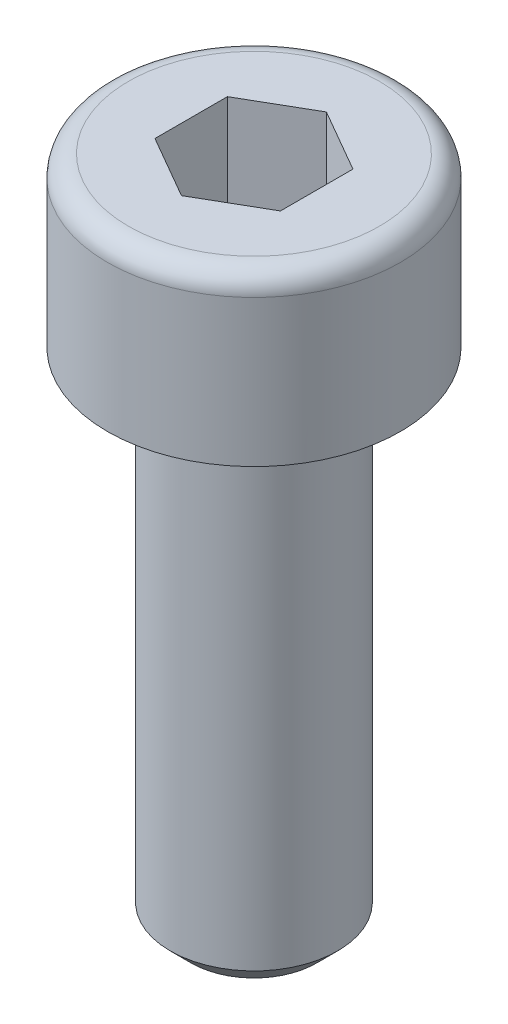
ISO-10303-21;
HEADER;
FILE_DESCRIPTION(('STEP AP214'),'2;1');
FILE_NAME('part.step','',(''),(''),'','','');
FILE_SCHEMA(('AUTOMOTIVE_DESIGN { 1 0 10303 214 1 1 1 1 }'));
ENDSEC;
DATA;
#1=APPLICATION_CONTEXT('core data for automotive mechanical design processes');
#2=APPLICATION_PROTOCOL_DEFINITION('international standard','automotive_design',2000,#1);
#3=PRODUCT_CONTEXT('',#1,'mechanical');
#4=PRODUCT('Part','Part','',(#3));
#5=PRODUCT_RELATED_PRODUCT_CATEGORY('part','',(#4));
#6=PRODUCT_DEFINITION_FORMATION('','',#4);
#7=PRODUCT_DEFINITION_CONTEXT('part definition',#1,'design');
#8=PRODUCT_DEFINITION('design','',#6,#7);
#9=PRODUCT_DEFINITION_SHAPE('','',#8);
#10=(LENGTH_UNIT() NAMED_UNIT(*) SI_UNIT(.MILLI.,.METRE.));
#11=(NAMED_UNIT(*) PLANE_ANGLE_UNIT() SI_UNIT($,.RADIAN.));
#12=(NAMED_UNIT(*) SI_UNIT($,.STERADIAN.) SOLID_ANGLE_UNIT());
#13=UNCERTAINTY_MEASURE_WITH_UNIT(LENGTH_MEASURE(1.E-05),#10,'distance_accuracy_value','');
#14=(GEOMETRIC_REPRESENTATION_CONTEXT(3) GLOBAL_UNCERTAINTY_ASSIGNED_CONTEXT((#13)) GLOBAL_UNIT_ASSIGNED_CONTEXT((#10,
#11,#12)) REPRESENTATION_CONTEXT('',''));
#15=CARTESIAN_POINT('',(0.,0.,0.));
#16=DIRECTION('',(0.,0.,1.));
#17=DIRECTION('',(1.,0.,0.));
#18=AXIS2_PLACEMENT_3D('',#15,#16,#17);
#19=CARTESIAN_POINT('',(0.,0.,0.));
#20=DIRECTION('',(0.,-1.,0.));
#21=DIRECTION('',(0.,0.,-1.));
#22=AXIS2_PLACEMENT_3D('',#19,#20,#21);
#23=PLANE('',#22);
#24=CARTESIAN_POINT('',(0.,0.,0.));
#25=DIRECTION('',(0.,-1.,0.));
#26=DIRECTION('',(0.,0.,-1.));
#27=AXIS2_PLACEMENT_3D('',#24,#25,#26);
#28=CIRCLE('',#27,3.);
#29=CARTESIAN_POINT('',(0.,0.,-3.));
#30=VERTEX_POINT('',#29);
#31=EDGE_CURVE('E42',#30,#30,#28,.F.);
#32=ORIENTED_EDGE('',*,*,#31,.T.);
#33=EDGE_LOOP('',(#32));
#34=FACE_BOUND('',#33,.T.);
#35=DIRECTION('',(-0.866025403784439,0.,-0.5));
#36=VECTOR('',#35,1.);
#37=CARTESIAN_POINT('',(1.5,0.,-0.866025403784438));
#38=LINE('',#37,#36);
#39=CARTESIAN_POINT('',(1.5,0.,-0.866025403784438));
#40=VERTEX_POINT('',#39);
#41=CARTESIAN_POINT('',(0.,0.,-1.73205080756888));
#42=VERTEX_POINT('',#41);
#43=EDGE_CURVE('E123',#40,#42,#38,.T.);
#44=ORIENTED_EDGE('',*,*,#43,.F.);
#45=DIRECTION('',(0.,0.,-1.));
#46=VECTOR('',#45,1.);
#47=CARTESIAN_POINT('',(1.5,0.,0.866025403784439));
#48=LINE('',#47,#46);
#49=CARTESIAN_POINT('',(1.5,0.,0.866025403784439));
#50=VERTEX_POINT('',#49);
#51=EDGE_CURVE('E49',#50,#40,#48,.T.);
#52=ORIENTED_EDGE('',*,*,#51,.F.);
#53=DIRECTION('',(0.866025403784439,0.,-0.5));
#54=VECTOR('',#53,1.);
#55=CARTESIAN_POINT('',(0.,0.,1.73205080756888));
#56=LINE('',#55,#54);
#57=CARTESIAN_POINT('',(0.,0.,1.73205080756888));
#58=VERTEX_POINT('',#57);
#59=EDGE_CURVE('E132',#58,#50,#56,.T.);
#60=ORIENTED_EDGE('',*,*,#59,.F.);
#61=DIRECTION('',(0.866025403784439,0.,0.5));
#62=VECTOR('',#61,1.);
#63=CARTESIAN_POINT('',(-1.5,0.,0.866025403784438));
#64=LINE('',#63,#62);
#65=CARTESIAN_POINT('',(-1.5,0.,0.866025403784438));
#66=VERTEX_POINT('',#65);
#67=EDGE_CURVE('E130',#66,#58,#64,.T.);
#68=ORIENTED_EDGE('',*,*,#67,.F.);
#69=DIRECTION('',(0.,0.,1.));
#70=VECTOR('',#69,1.);
#71=CARTESIAN_POINT('',(-1.5,0.,-0.866025403784439));
#72=LINE('',#71,#70);
#73=CARTESIAN_POINT('',(-1.5,0.,-0.866025403784439));
#74=VERTEX_POINT('',#73);
#75=EDGE_CURVE('E97',#74,#66,#72,.T.);
#76=ORIENTED_EDGE('',*,*,#75,.F.);
#77=DIRECTION('',(-0.866025403784439,0.,0.5));
#78=VECTOR('',#77,1.);
#79=CARTESIAN_POINT('',(0.,0.,-1.73205080756888));
#80=LINE('',#79,#78);
#81=EDGE_CURVE('E126',#42,#74,#80,.T.);
#82=ORIENTED_EDGE('',*,*,#81,.F.);
#83=EDGE_LOOP('',(#44,#52,#60,#68,#76,#82));
#84=FACE_BOUND('',#83,.T.);
#85=ADVANCED_FACE('F34',(#34,#84),#23,.F.);
#86=CARTESIAN_POINT('',(0.,0.,0.));
#87=DIRECTION('',(0.,1.,0.));
#88=DIRECTION('',(0.,0.,1.));
#89=AXIS2_PLACEMENT_3D('',#86,#87,#88);
#90=CYLINDRICAL_SURFACE('',#89,3.5);
#91=CARTESIAN_POINT('',(0.,-0.5,0.));
#92=DIRECTION('',(0.,-1.,0.));
#93=DIRECTION('',(0.,0.,-1.));
#94=AXIS2_PLACEMENT_3D('',#91,#92,#93);
#95=CIRCLE('',#94,3.5);
#96=CARTESIAN_POINT('',(0.,-0.5,-3.5));
#97=VERTEX_POINT('',#96);
#98=EDGE_CURVE('E11',#97,#97,#95,.T.);
#99=ORIENTED_EDGE('',*,*,#98,.T.);
#100=EDGE_LOOP('',(#99));
#101=FACE_BOUND('',#100,.T.);
#102=CARTESIAN_POINT('',(0.,-4.,0.));
#103=DIRECTION('',(0.,1.,0.));
#104=DIRECTION('',(0.,0.,1.));
#105=AXIS2_PLACEMENT_3D('',#102,#103,#104);
#106=CIRCLE('',#105,3.5);
#107=CARTESIAN_POINT('',(0.,-4.,3.5));
#108=VERTEX_POINT('',#107);
#109=EDGE_CURVE('E144',#108,#108,#106,.T.);
#110=ORIENTED_EDGE('',*,*,#109,.T.);
#111=EDGE_LOOP('',(#110));
#112=FACE_BOUND('',#111,.T.);
#113=ADVANCED_FACE('F166',(#101,#112),#90,.T.);
#114=CARTESIAN_POINT('',(3.5,-4.,0.));
#115=DIRECTION('',(0.,1.,0.));
#116=DIRECTION('',(0.,0.,1.));
#117=AXIS2_PLACEMENT_3D('',#114,#115,#116);
#118=PLANE('',#117);
#119=ORIENTED_EDGE('',*,*,#109,.F.);
#120=EDGE_LOOP('',(#119));
#121=FACE_BOUND('',#120,.T.);
#122=CARTESIAN_POINT('',(0.,-4.,0.));
#123=DIRECTION('',(0.,1.,0.));
#124=DIRECTION('',(0.,0.,1.));
#125=AXIS2_PLACEMENT_3D('',#122,#123,#124);
#126=CIRCLE('',#125,2.);
#127=CARTESIAN_POINT('',(0.,-4.,2.));
#128=VERTEX_POINT('',#127);
#129=EDGE_CURVE('E136',#128,#128,#126,.T.);
#130=ORIENTED_EDGE('',*,*,#129,.T.);
#131=EDGE_LOOP('',(#130));
#132=FACE_BOUND('',#131,.T.);
#133=ADVANCED_FACE('F171',(#121,#132),#118,.F.);
#134=CARTESIAN_POINT('',(0.,0.,0.));
#135=DIRECTION('',(0.,1.,0.));
#136=DIRECTION('',(0.,0.,1.));
#137=AXIS2_PLACEMENT_3D('',#134,#135,#136);
#138=CYLINDRICAL_SURFACE('',#137,2.);
#139=CARTESIAN_POINT('',(0.,-15.5,0.));
#140=DIRECTION('',(0.,1.,0.));
#141=DIRECTION('',(0.,0.,1.));
#142=AXIS2_PLACEMENT_3D('',#139,#140,#141);
#143=CIRCLE('',#142,2.);
#144=CARTESIAN_POINT('',(0.,-15.5,2.));
#145=VERTEX_POINT('',#144);
#146=EDGE_CURVE('E147',#145,#145,#143,.T.);
#147=ORIENTED_EDGE('',*,*,#146,.T.);
#148=EDGE_LOOP('',(#147));
#149=FACE_BOUND('',#148,.T.);
#150=ORIENTED_EDGE('',*,*,#129,.F.);
#151=EDGE_LOOP('',(#150));
#152=FACE_BOUND('',#151,.T.);
#153=ADVANCED_FACE('F177',(#149,#152),#138,.T.);
#154=CARTESIAN_POINT('',(2.,-16.,0.));
#155=DIRECTION('',(0.,1.,0.));
#156=DIRECTION('',(0.,0.,1.));
#157=AXIS2_PLACEMENT_3D('',#154,#155,#156);
#158=PLANE('',#157);
#159=CARTESIAN_POINT('',(0.,-16.,0.));
#160=DIRECTION('',(0.,1.,0.));
#161=DIRECTION('',(0.,0.,1.));
#162=AXIS2_PLACEMENT_3D('',#159,#160,#161);
#163=CIRCLE('',#162,1.5);
#164=CARTESIAN_POINT('',(0.,-16.,1.5));
#165=VERTEX_POINT('',#164);
#166=EDGE_CURVE('E150',#165,#165,#163,.F.);
#167=ORIENTED_EDGE('',*,*,#166,.T.);
#168=EDGE_LOOP('',(#167));
#169=FACE_BOUND('',#168,.T.);
#170=ADVANCED_FACE('F181',(#169),#158,.F.);
#171=CARTESIAN_POINT('',(1.5,-3.,0.866025403784439));
#172=DIRECTION('',(1.,0.,0.));
#173=DIRECTION('',(0.,0.,-1.));
#174=AXIS2_PLACEMENT_3D('',#171,#172,#173);
#175=PLANE('',#174);
#176=ORIENTED_EDGE('',*,*,#51,.T.);
#177=DIRECTION('',(0.,1.,0.));
#178=VECTOR('',#177,1.);
#179=CARTESIAN_POINT('',(1.5,-3.,-0.866025403784438));
#180=LINE('',#179,#178);
#181=CARTESIAN_POINT('',(1.5,-3.,-0.866025403784438));
#182=VERTEX_POINT('',#181);
#183=EDGE_CURVE('E79',#182,#40,#180,.T.);
#184=ORIENTED_EDGE('',*,*,#183,.F.);
#185=DIRECTION('',(0.,0.,-1.));
#186=VECTOR('',#185,1.);
#187=CARTESIAN_POINT('',(1.5,-3.,0.866025403784439));
#188=LINE('',#187,#186);
#189=CARTESIAN_POINT('',(1.5,-3.,0.866025403784439));
#190=VERTEX_POINT('',#189);
#191=EDGE_CURVE('E134',#190,#182,#188,.T.);
#192=ORIENTED_EDGE('',*,*,#191,.F.);
#193=DIRECTION('',(0.,1.,0.));
#194=VECTOR('',#193,1.);
#195=CARTESIAN_POINT('',(1.5,-3.,0.866025403784439));
#196=LINE('',#195,#194);
#197=EDGE_CURVE('E57',#190,#50,#196,.T.);
#198=ORIENTED_EDGE('',*,*,#197,.T.);
#199=EDGE_LOOP('',(#176,#184,#192,#198));
#200=FACE_BOUND('',#199,.T.);
#201=ADVANCED_FACE('F185',(#200),#175,.F.);
#202=CARTESIAN_POINT('',(0.,-3.,1.73205080756888));
#203=DIRECTION('',(0.5,0.,0.866025403784439));
#204=DIRECTION('',(0.866025403784439,0.,-0.5));
#205=AXIS2_PLACEMENT_3D('',#202,#203,#204);
#206=PLANE('',#205);
#207=ORIENTED_EDGE('',*,*,#59,.T.);
#208=ORIENTED_EDGE('',*,*,#197,.F.);
#209=DIRECTION('',(0.866025403784439,0.,-0.5));
#210=VECTOR('',#209,1.);
#211=CARTESIAN_POINT('',(0.,-3.,1.73205080756888));
#212=LINE('',#211,#210);
#213=CARTESIAN_POINT('',(0.,-3.,1.73205080756888));
#214=VERTEX_POINT('',#213);
#215=EDGE_CURVE('E109',#214,#190,#212,.T.);
#216=ORIENTED_EDGE('',*,*,#215,.F.);
#217=DIRECTION('',(0.,1.,0.));
#218=VECTOR('',#217,1.);
#219=CARTESIAN_POINT('',(0.,-3.,1.73205080756888));
#220=LINE('',#219,#218);
#221=EDGE_CURVE('E101',#214,#58,#220,.T.);
#222=ORIENTED_EDGE('',*,*,#221,.T.);
#223=EDGE_LOOP('',(#207,#208,#216,#222));
#224=FACE_BOUND('',#223,.T.);
#225=ADVANCED_FACE('F189',(#224),#206,.F.);
#226=CARTESIAN_POINT('',(-1.5,-3.,0.866025403784438));
#227=DIRECTION('',(-0.5,0.,0.866025403784438));
#228=DIRECTION('',(0.866025403784439,0.,0.5));
#229=AXIS2_PLACEMENT_3D('',#226,#227,#228);
#230=PLANE('',#229);
#231=ORIENTED_EDGE('',*,*,#67,.T.);
#232=ORIENTED_EDGE('',*,*,#221,.F.);
#233=DIRECTION('',(0.866025403784439,0.,0.5));
#234=VECTOR('',#233,1.);
#235=CARTESIAN_POINT('',(-1.5,-3.,0.866025403784438));
#236=LINE('',#235,#234);
#237=CARTESIAN_POINT('',(-1.5,-3.,0.866025403784438));
#238=VERTEX_POINT('',#237);
#239=EDGE_CURVE('E105',#238,#214,#236,.T.);
#240=ORIENTED_EDGE('',*,*,#239,.F.);
#241=DIRECTION('',(0.,1.,0.));
#242=VECTOR('',#241,1.);
#243=CARTESIAN_POINT('',(-1.5,-3.,0.866025403784438));
#244=LINE('',#243,#242);
#245=EDGE_CURVE('E90',#238,#66,#244,.T.);
#246=ORIENTED_EDGE('',*,*,#245,.T.);
#247=EDGE_LOOP('',(#231,#232,#240,#246));
#248=FACE_BOUND('',#247,.T.);
#249=ADVANCED_FACE('F106',(#248),#230,.F.);
#250=CARTESIAN_POINT('',(-1.5,-3.,-0.866025403784439));
#251=DIRECTION('',(-1.,0.,0.));
#252=DIRECTION('',(0.,0.,1.));
#253=AXIS2_PLACEMENT_3D('',#250,#251,#252);
#254=PLANE('',#253);
#255=ORIENTED_EDGE('',*,*,#75,.T.);
#256=ORIENTED_EDGE('',*,*,#245,.F.);
#257=DIRECTION('',(0.,0.,1.));
#258=VECTOR('',#257,1.);
#259=CARTESIAN_POINT('',(-1.5,-3.,-0.866025403784439));
#260=LINE('',#259,#258);
#261=CARTESIAN_POINT('',(-1.5,-3.,-0.866025403784439));
#262=VERTEX_POINT('',#261);
#263=EDGE_CURVE('E94',#262,#238,#260,.T.);
#264=ORIENTED_EDGE('',*,*,#263,.F.);
#265=DIRECTION('',(0.,1.,0.));
#266=VECTOR('',#265,1.);
#267=CARTESIAN_POINT('',(-1.5,-3.,-0.866025403784439));
#268=LINE('',#267,#266);
#269=EDGE_CURVE('E102',#262,#74,#268,.T.);
#270=ORIENTED_EDGE('',*,*,#269,.T.);
#271=EDGE_LOOP('',(#255,#256,#264,#270));
#272=FACE_BOUND('',#271,.T.);
#273=ADVANCED_FACE('F92',(#272),#254,.F.);
#274=CARTESIAN_POINT('',(0.,-3.,-1.73205080756888));
#275=DIRECTION('',(-0.5,0.,-0.866025403784439));
#276=DIRECTION('',(-0.866025403784439,0.,0.5));
#277=AXIS2_PLACEMENT_3D('',#274,#275,#276);
#278=PLANE('',#277);
#279=ORIENTED_EDGE('',*,*,#81,.T.);
#280=ORIENTED_EDGE('',*,*,#269,.F.);
#281=DIRECTION('',(-0.866025403784439,0.,0.5));
#282=VECTOR('',#281,1.);
#283=CARTESIAN_POINT('',(0.,-3.,-1.73205080756888));
#284=LINE('',#283,#282);
#285=CARTESIAN_POINT('',(0.,-3.,-1.73205080756888));
#286=VERTEX_POINT('',#285);
#287=EDGE_CURVE('E115',#286,#262,#284,.T.);
#288=ORIENTED_EDGE('',*,*,#287,.F.);
#289=DIRECTION('',(0.,1.,0.));
#290=VECTOR('',#289,1.);
#291=CARTESIAN_POINT('',(0.,-3.,-1.73205080756888));
#292=LINE('',#291,#290);
#293=EDGE_CURVE('E139',#286,#42,#292,.T.);
#294=ORIENTED_EDGE('',*,*,#293,.T.);
#295=EDGE_LOOP('',(#279,#280,#288,#294));
#296=FACE_BOUND('',#295,.T.);
#297=ADVANCED_FACE('F193',(#296),#278,.F.);
#298=CARTESIAN_POINT('',(1.5,-3.,-0.866025403784438));
#299=DIRECTION('',(0.5,0.,-0.866025403784439));
#300=DIRECTION('',(-0.866025403784439,0.,-0.5));
#301=AXIS2_PLACEMENT_3D('',#298,#299,#300);
#302=PLANE('',#301);
#303=ORIENTED_EDGE('',*,*,#43,.T.);
#304=ORIENTED_EDGE('',*,*,#293,.F.);
#305=DIRECTION('',(-0.866025403784439,0.,-0.5));
#306=VECTOR('',#305,1.);
#307=CARTESIAN_POINT('',(1.5,-3.,-0.866025403784438));
#308=LINE('',#307,#306);
#309=EDGE_CURVE('E117',#182,#286,#308,.T.);
#310=ORIENTED_EDGE('',*,*,#309,.F.);
#311=ORIENTED_EDGE('',*,*,#183,.T.);
#312=EDGE_LOOP('',(#303,#304,#310,#311));
#313=FACE_BOUND('',#312,.T.);
#314=ADVANCED_FACE('F190',(#313),#302,.F.);
#315=CARTESIAN_POINT('',(1.5,-3.,-0.866025403784438));
#316=DIRECTION('',(0.,1.,0.));
#317=DIRECTION('',(0.,0.,1.));
#318=AXIS2_PLACEMENT_3D('',#315,#316,#317);
#319=PLANE('',#318);
#320=ORIENTED_EDGE('',*,*,#191,.T.);
#321=ORIENTED_EDGE('',*,*,#309,.T.);
#322=ORIENTED_EDGE('',*,*,#287,.T.);
#323=ORIENTED_EDGE('',*,*,#263,.T.);
#324=ORIENTED_EDGE('',*,*,#239,.T.);
#325=ORIENTED_EDGE('',*,*,#215,.T.);
#326=EDGE_LOOP('',(#320,#321,#322,#323,#324,#325));
#327=FACE_BOUND('',#326,.T.);
#328=ADVANCED_FACE('F112',(#327),#319,.T.);
#329=CARTESIAN_POINT('',(0.,-15.5,0.));
#330=DIRECTION('',(0.,1.,0.));
#331=DIRECTION('',(0.,0.,1.));
#332=AXIS2_PLACEMENT_3D('',#329,#330,#331);
#333=CONICAL_SURFACE('',#332,2.,0.785398163397451);
#334=ORIENTED_EDGE('',*,*,#166,.F.);
#335=EDGE_LOOP('',(#334));
#336=FACE_BOUND('',#335,.T.);
#337=ORIENTED_EDGE('',*,*,#146,.F.);
#338=EDGE_LOOP('',(#337));
#339=FACE_BOUND('',#338,.T.);
#340=ADVANCED_FACE('F158',(#336,#339),#333,.T.);
#341=CARTESIAN_POINT('',(0.,-0.5,0.));
#342=DIRECTION('',(0.,-1.,0.));
#343=DIRECTION('',(0.,0.,-1.));
#344=AXIS2_PLACEMENT_3D('',#341,#342,#343);
#345=TOROIDAL_SURFACE('',#344,3.,0.5);
#346=ORIENTED_EDGE('',*,*,#98,.F.);
#347=EDGE_LOOP('',(#346));
#348=FACE_BOUND('',#347,.T.);
#349=ORIENTED_EDGE('',*,*,#31,.F.);
#350=EDGE_LOOP('',(#349));
#351=FACE_BOUND('',#350,.T.);
#352=ADVANCED_FACE('F36',(#348,#351),#345,.T.);
#353=CLOSED_SHELL('',(#85,#113,#133,#153,#170,#201,#225,#249,#273,#297,#314,#328,#340,#352));
#354=MANIFOLD_SOLID_BREP('B2',#353);
#355=ADVANCED_BREP_SHAPE_REPRESENTATION('',(#18,#354),#14);
#356=SHAPE_DEFINITION_REPRESENTATION(#9,#355);
ENDSEC;
END-ISO-10303-21;
